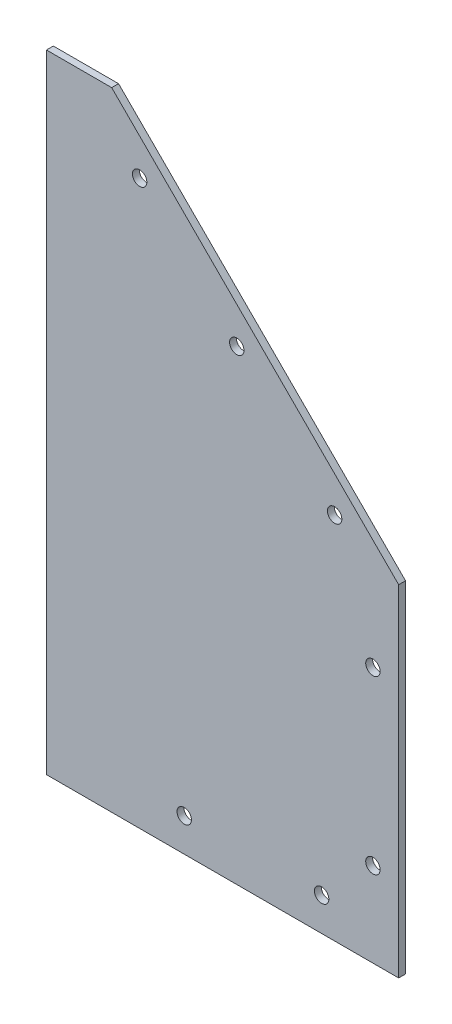
ISO-10303-21;
HEADER;
FILE_DESCRIPTION(('STEP AP214'),'2;1');
FILE_NAME('part.step','',(''),(''),'','','');
FILE_SCHEMA(('AUTOMOTIVE_DESIGN { 1 0 10303 214 1 1 1 1 }'));
ENDSEC;
DATA;
#1=APPLICATION_CONTEXT('core data for automotive mechanical design processes');
#2=APPLICATION_PROTOCOL_DEFINITION('international standard','automotive_design',2000,#1);
#3=PRODUCT_CONTEXT('',#1,'mechanical');
#4=PRODUCT('Part','Part','',(#3));
#5=PRODUCT_RELATED_PRODUCT_CATEGORY('part','',(#4));
#6=PRODUCT_DEFINITION_FORMATION('','',#4);
#7=PRODUCT_DEFINITION_CONTEXT('part definition',#1,'design');
#8=PRODUCT_DEFINITION('design','',#6,#7);
#9=PRODUCT_DEFINITION_SHAPE('','',#8);
#10=(LENGTH_UNIT() NAMED_UNIT(*) SI_UNIT(.MILLI.,.METRE.));
#11=(NAMED_UNIT(*) PLANE_ANGLE_UNIT() SI_UNIT($,.RADIAN.));
#12=(NAMED_UNIT(*) SI_UNIT($,.STERADIAN.) SOLID_ANGLE_UNIT());
#13=UNCERTAINTY_MEASURE_WITH_UNIT(LENGTH_MEASURE(1.E-05),#10,'distance_accuracy_value','');
#14=(GEOMETRIC_REPRESENTATION_CONTEXT(3) GLOBAL_UNCERTAINTY_ASSIGNED_CONTEXT((#13)) GLOBAL_UNIT_ASSIGNED_CONTEXT((#10,
#11,#12)) REPRESENTATION_CONTEXT('',''));
#15=CARTESIAN_POINT('',(0.,0.,0.));
#16=DIRECTION('',(0.,0.,1.));
#17=DIRECTION('',(1.,0.,0.));
#18=AXIS2_PLACEMENT_3D('',#15,#16,#17);
#19=CARTESIAN_POINT('',(0.,0.,2.));
#20=DIRECTION('',(0.,-1.,0.));
#21=DIRECTION('',(1.,0.,0.));
#22=AXIS2_PLACEMENT_3D('',#19,#20,#21);
#23=PLANE('',#22);
#24=DIRECTION('',(-1.,0.,0.));
#25=VECTOR('',#24,1.);
#26=CARTESIAN_POINT('',(0.,0.,0.));
#27=LINE('',#26,#25);
#28=CARTESIAN_POINT('',(83.56,0.,0.));
#29=VERTEX_POINT('',#28);
#30=CARTESIAN_POINT('',(-19.,0.,0.));
#31=VERTEX_POINT('',#30);
#32=EDGE_CURVE('E90',#29,#31,#27,.T.);
#33=ORIENTED_EDGE('',*,*,#32,.F.);
#34=DIRECTION('',(0.,0.,-1.));
#35=VECTOR('',#34,1.);
#36=CARTESIAN_POINT('',(83.56,0.,2.));
#37=LINE('',#36,#35);
#38=CARTESIAN_POINT('',(83.56,0.,2.));
#39=VERTEX_POINT('',#38);
#40=EDGE_CURVE('E11',#39,#29,#37,.T.);
#41=ORIENTED_EDGE('',*,*,#40,.F.);
#42=DIRECTION('',(-1.,0.,0.));
#43=VECTOR('',#42,1.);
#44=CARTESIAN_POINT('',(0.,0.,2.));
#45=LINE('',#44,#43);
#46=CARTESIAN_POINT('',(-19.,0.,2.));
#47=VERTEX_POINT('',#46);
#48=EDGE_CURVE('E87',#39,#47,#45,.T.);
#49=ORIENTED_EDGE('',*,*,#48,.T.);
#50=DIRECTION('',(0.,0.,1.));
#51=VECTOR('',#50,1.);
#52=CARTESIAN_POINT('',(-19.,0.,0.));
#53=LINE('',#52,#51);
#54=EDGE_CURVE('E215',#31,#47,#53,.T.);
#55=ORIENTED_EDGE('',*,*,#54,.F.);
#56=EDGE_LOOP('',(#33,#41,#49,#55));
#57=FACE_BOUND('',#56,.T.);
#58=ADVANCED_FACE('F35',(#57),#23,.T.);
#59=CARTESIAN_POINT('',(83.56,0.,2.));
#60=DIRECTION('',(1.,0.,0.));
#61=DIRECTION('',(0.,1.,0.));
#62=AXIS2_PLACEMENT_3D('',#59,#60,#61);
#63=PLANE('',#62);
#64=DIRECTION('',(0.,-1.,0.));
#65=VECTOR('',#64,1.);
#66=CARTESIAN_POINT('',(83.56,0.,0.));
#67=LINE('',#66,#65);
#68=CARTESIAN_POINT('',(83.56,99.17,0.));
#69=VERTEX_POINT('',#68);
#70=EDGE_CURVE('E123',#69,#29,#67,.T.);
#71=ORIENTED_EDGE('',*,*,#70,.F.);
#72=DIRECTION('',(0.,0.,-1.));
#73=VECTOR('',#72,1.);
#74=CARTESIAN_POINT('',(83.56,99.17,2.));
#75=LINE('',#74,#73);
#76=CARTESIAN_POINT('',(83.56,99.17,2.));
#77=VERTEX_POINT('',#76);
#78=EDGE_CURVE('E45',#77,#69,#75,.T.);
#79=ORIENTED_EDGE('',*,*,#78,.F.);
#80=DIRECTION('',(0.,-1.,0.));
#81=VECTOR('',#80,1.);
#82=CARTESIAN_POINT('',(83.56,0.,2.));
#83=LINE('',#82,#81);
#84=EDGE_CURVE('E96',#77,#39,#83,.T.);
#85=ORIENTED_EDGE('',*,*,#84,.T.);
#86=ORIENTED_EDGE('',*,*,#40,.T.);
#87=EDGE_LOOP('',(#71,#79,#85,#86));
#88=FACE_BOUND('',#87,.T.);
#89=ADVANCED_FACE('F101',(#88),#63,.T.);
#90=CARTESIAN_POINT('',(91.365,91.365,2.));
#91=DIRECTION('',(0.707106781186547,0.707106781186547,0.));
#92=DIRECTION('',(-0.707106781186548,0.707106781186548,0.));
#93=AXIS2_PLACEMENT_3D('',#90,#91,#92);
#94=PLANE('',#93);
#95=DIRECTION('',(0.707106781186548,-0.707106781186548,0.));
#96=VECTOR('',#95,1.);
#97=CARTESIAN_POINT('',(91.365,91.365,0.));
#98=LINE('',#97,#96);
#99=CARTESIAN_POINT('',(0.,182.73,0.));
#100=VERTEX_POINT('',#99);
#101=EDGE_CURVE('E125',#100,#69,#98,.T.);
#102=ORIENTED_EDGE('',*,*,#101,.F.);
#103=DIRECTION('',(0.,0.,-1.));
#104=VECTOR('',#103,1.);
#105=CARTESIAN_POINT('',(0.,182.73,2.));
#106=LINE('',#105,#104);
#107=CARTESIAN_POINT('',(0.,182.73,2.));
#108=VERTEX_POINT('',#107);
#109=EDGE_CURVE('E54',#108,#100,#106,.T.);
#110=ORIENTED_EDGE('',*,*,#109,.F.);
#111=DIRECTION('',(0.707106781186548,-0.707106781186548,0.));
#112=VECTOR('',#111,1.);
#113=CARTESIAN_POINT('',(91.365,91.365,2.));
#114=LINE('',#113,#112);
#115=EDGE_CURVE('E102',#108,#77,#114,.T.);
#116=ORIENTED_EDGE('',*,*,#115,.T.);
#117=ORIENTED_EDGE('',*,*,#78,.T.);
#118=EDGE_LOOP('',(#102,#110,#116,#117));
#119=FACE_BOUND('',#118,.T.);
#120=ADVANCED_FACE('F183',(#119),#94,.T.);
#121=CARTESIAN_POINT('',(8.13291965083095,163.990478631371,2.));
#122=DIRECTION('',(0.,0.,-1.));
#123=DIRECTION('',(-1.,0.,0.));
#124=AXIS2_PLACEMENT_3D('',#121,#122,#123);
#125=CYLINDRICAL_SURFACE('',#124,2.10000000000004);
#126=CARTESIAN_POINT('',(8.13291965083095,163.990478631371,2.));
#127=DIRECTION('',(0.,0.,1.));
#128=DIRECTION('',(1.,0.,0.));
#129=AXIS2_PLACEMENT_3D('',#126,#127,#128);
#130=CIRCLE('',#129,2.10000000000004);
#131=CARTESIAN_POINT('',(10.232919650831,163.990478631371,2.));
#132=VERTEX_POINT('',#131);
#133=EDGE_CURVE('E99',#132,#132,#130,.T.);
#134=ORIENTED_EDGE('',*,*,#133,.T.);
#135=EDGE_LOOP('',(#134));
#136=FACE_BOUND('',#135,.T.);
#137=CARTESIAN_POINT('',(8.13291965083095,163.990478631371,0.));
#138=DIRECTION('',(0.,0.,1.));
#139=DIRECTION('',(1.,0.,0.));
#140=AXIS2_PLACEMENT_3D('',#137,#138,#139);
#141=CIRCLE('',#140,2.10000000000004);
#142=CARTESIAN_POINT('',(10.232919650831,163.990478631371,0.));
#143=VERTEX_POINT('',#142);
#144=EDGE_CURVE('E119',#143,#143,#141,.T.);
#145=ORIENTED_EDGE('',*,*,#144,.F.);
#146=EDGE_LOOP('',(#145));
#147=FACE_BOUND('',#146,.T.);
#148=ADVANCED_FACE('F160',(#136,#147),#125,.F.);
#149=CARTESIAN_POINT('',(36.4171908982929,135.706207383909,2.));
#150=DIRECTION('',(0.,0.,-1.));
#151=DIRECTION('',(-1.,0.,0.));
#152=AXIS2_PLACEMENT_3D('',#149,#150,#151);
#153=CYLINDRICAL_SURFACE('',#152,2.09999999999999);
#154=CARTESIAN_POINT('',(36.4171908982929,135.706207383909,2.));
#155=DIRECTION('',(0.,0.,1.));
#156=DIRECTION('',(1.,0.,0.));
#157=AXIS2_PLACEMENT_3D('',#154,#155,#156);
#158=CIRCLE('',#157,2.09999999999999);
#159=CARTESIAN_POINT('',(38.5171908982928,135.706207383909,2.));
#160=VERTEX_POINT('',#159);
#161=EDGE_CURVE('E155',#160,#160,#158,.T.);
#162=ORIENTED_EDGE('',*,*,#161,.T.);
#163=EDGE_LOOP('',(#162));
#164=FACE_BOUND('',#163,.T.);
#165=CARTESIAN_POINT('',(36.4171908982929,135.706207383909,0.));
#166=DIRECTION('',(0.,0.,1.));
#167=DIRECTION('',(1.,0.,0.));
#168=AXIS2_PLACEMENT_3D('',#165,#166,#167);
#169=CIRCLE('',#168,2.09999999999999);
#170=CARTESIAN_POINT('',(38.5171908982928,135.706207383909,0.));
#171=VERTEX_POINT('',#170);
#172=EDGE_CURVE('E116',#171,#171,#169,.T.);
#173=ORIENTED_EDGE('',*,*,#172,.F.);
#174=EDGE_LOOP('',(#173));
#175=FACE_BOUND('',#174,.T.);
#176=ADVANCED_FACE('F189',(#164,#175),#153,.F.);
#177=CARTESIAN_POINT('',(64.9100261398927,107.42849037455,2.));
#178=DIRECTION('',(0.,0.,-1.));
#179=DIRECTION('',(-1.,0.,0.));
#180=AXIS2_PLACEMENT_3D('',#177,#178,#179);
#181=CYLINDRICAL_SURFACE('',#180,2.1);
#182=CARTESIAN_POINT('',(64.9100261398927,107.42849037455,2.));
#183=DIRECTION('',(0.,0.,1.));
#184=DIRECTION('',(1.,0.,0.));
#185=AXIS2_PLACEMENT_3D('',#182,#183,#184);
#186=CIRCLE('',#185,2.1);
#187=CARTESIAN_POINT('',(67.0100261398927,107.42849037455,2.));
#188=VERTEX_POINT('',#187);
#189=EDGE_CURVE('E152',#188,#188,#186,.T.);
#190=ORIENTED_EDGE('',*,*,#189,.T.);
#191=EDGE_LOOP('',(#190));
#192=FACE_BOUND('',#191,.T.);
#193=CARTESIAN_POINT('',(64.9100261398927,107.42849037455,0.));
#194=DIRECTION('',(0.,0.,1.));
#195=DIRECTION('',(1.,0.,0.));
#196=AXIS2_PLACEMENT_3D('',#193,#194,#195);
#197=CIRCLE('',#196,2.1);
#198=CARTESIAN_POINT('',(67.0100261398927,107.42849037455,0.));
#199=VERTEX_POINT('',#198);
#200=EDGE_CURVE('E113',#199,#199,#197,.T.);
#201=ORIENTED_EDGE('',*,*,#200,.F.);
#202=EDGE_LOOP('',(#201));
#203=FACE_BOUND('',#202,.T.);
#204=ADVANCED_FACE('F192',(#192,#203),#181,.F.);
#205=CARTESIAN_POINT('',(76.06,74.59,2.));
#206=DIRECTION('',(0.,0.,-1.));
#207=DIRECTION('',(-1.,0.,0.));
#208=AXIS2_PLACEMENT_3D('',#205,#206,#207);
#209=CYLINDRICAL_SURFACE('',#208,2.1);
#210=CARTESIAN_POINT('',(76.06,74.59,2.));
#211=DIRECTION('',(0.,0.,1.));
#212=DIRECTION('',(1.,0.,0.));
#213=AXIS2_PLACEMENT_3D('',#210,#211,#212);
#214=CIRCLE('',#213,2.1);
#215=CARTESIAN_POINT('',(78.16,74.59,2.));
#216=VERTEX_POINT('',#215);
#217=EDGE_CURVE('E149',#216,#216,#214,.T.);
#218=ORIENTED_EDGE('',*,*,#217,.T.);
#219=EDGE_LOOP('',(#218));
#220=FACE_BOUND('',#219,.T.);
#221=CARTESIAN_POINT('',(76.06,74.59,0.));
#222=DIRECTION('',(0.,0.,1.));
#223=DIRECTION('',(1.,0.,0.));
#224=AXIS2_PLACEMENT_3D('',#221,#222,#223);
#225=CIRCLE('',#224,2.1);
#226=CARTESIAN_POINT('',(78.16,74.59,0.));
#227=VERTEX_POINT('',#226);
#228=EDGE_CURVE('E110',#227,#227,#225,.T.);
#229=ORIENTED_EDGE('',*,*,#228,.F.);
#230=EDGE_LOOP('',(#229));
#231=FACE_BOUND('',#230,.T.);
#232=ADVANCED_FACE('F174',(#220,#231),#209,.F.);
#233=CARTESIAN_POINT('',(76.06,24.59,2.));
#234=DIRECTION('',(0.,0.,-1.));
#235=DIRECTION('',(-1.,0.,0.));
#236=AXIS2_PLACEMENT_3D('',#233,#234,#235);
#237=CYLINDRICAL_SURFACE('',#236,2.1);
#238=CARTESIAN_POINT('',(76.06,24.59,2.));
#239=DIRECTION('',(0.,0.,1.));
#240=DIRECTION('',(1.,0.,0.));
#241=AXIS2_PLACEMENT_3D('',#238,#239,#240);
#242=CIRCLE('',#241,2.1);
#243=CARTESIAN_POINT('',(78.16,24.59,2.));
#244=VERTEX_POINT('',#243);
#245=EDGE_CURVE('E128',#244,#244,#242,.T.);
#246=ORIENTED_EDGE('',*,*,#245,.T.);
#247=EDGE_LOOP('',(#246));
#248=FACE_BOUND('',#247,.T.);
#249=CARTESIAN_POINT('',(76.06,24.59,0.));
#250=DIRECTION('',(0.,0.,1.));
#251=DIRECTION('',(1.,0.,0.));
#252=AXIS2_PLACEMENT_3D('',#249,#250,#251);
#253=CIRCLE('',#252,2.1);
#254=CARTESIAN_POINT('',(78.16,24.59,0.));
#255=VERTEX_POINT('',#254);
#256=EDGE_CURVE('E107',#255,#255,#253,.T.);
#257=ORIENTED_EDGE('',*,*,#256,.F.);
#258=EDGE_LOOP('',(#257));
#259=FACE_BOUND('',#258,.T.);
#260=ADVANCED_FACE('F37',(#248,#259),#237,.F.);
#261=CARTESIAN_POINT('',(0.,0.,2.));
#262=DIRECTION('',(0.,0.,1.));
#263=DIRECTION('',(1.,0.,0.));
#264=AXIS2_PLACEMENT_3D('',#261,#262,#263);
#265=PLANE('',#264);
#266=CARTESIAN_POINT('',(21.12,9.69,2.));
#267=DIRECTION('',(0.,0.,1.));
#268=DIRECTION('',(1.,0.,0.));
#269=AXIS2_PLACEMENT_3D('',#266,#267,#268);
#270=CIRCLE('',#269,2.1);
#271=CARTESIAN_POINT('',(23.22,9.69,2.));
#272=VERTEX_POINT('',#271);
#273=EDGE_CURVE('E132',#272,#272,#270,.T.);
#274=ORIENTED_EDGE('',*,*,#273,.F.);
#275=EDGE_LOOP('',(#274));
#276=FACE_BOUND('',#275,.T.);
#277=CARTESIAN_POINT('',(61.12,9.69,2.));
#278=DIRECTION('',(0.,0.,1.));
#279=DIRECTION('',(1.,0.,0.));
#280=AXIS2_PLACEMENT_3D('',#277,#278,#279);
#281=CIRCLE('',#280,2.1);
#282=CARTESIAN_POINT('',(63.22,9.69,2.));
#283=VERTEX_POINT('',#282);
#284=EDGE_CURVE('E137',#283,#283,#281,.T.);
#285=ORIENTED_EDGE('',*,*,#284,.F.);
#286=EDGE_LOOP('',(#285));
#287=FACE_BOUND('',#286,.T.);
#288=ORIENTED_EDGE('',*,*,#245,.F.);
#289=EDGE_LOOP('',(#288));
#290=FACE_BOUND('',#289,.T.);
#291=ORIENTED_EDGE('',*,*,#217,.F.);
#292=EDGE_LOOP('',(#291));
#293=FACE_BOUND('',#292,.T.);
#294=ORIENTED_EDGE('',*,*,#189,.F.);
#295=EDGE_LOOP('',(#294));
#296=FACE_BOUND('',#295,.T.);
#297=ORIENTED_EDGE('',*,*,#161,.F.);
#298=EDGE_LOOP('',(#297));
#299=FACE_BOUND('',#298,.T.);
#300=ORIENTED_EDGE('',*,*,#133,.F.);
#301=EDGE_LOOP('',(#300));
#302=FACE_BOUND('',#301,.T.);
#303=ORIENTED_EDGE('',*,*,#48,.F.);
#304=ORIENTED_EDGE('',*,*,#84,.F.);
#305=ORIENTED_EDGE('',*,*,#115,.F.);
#306=DIRECTION('',(1.,0.,0.));
#307=VECTOR('',#306,1.);
#308=CARTESIAN_POINT('',(-19.,182.73,1.99999999999998));
#309=LINE('',#308,#307);
#310=CARTESIAN_POINT('',(-19.,182.73,1.99999999999998));
#311=VERTEX_POINT('',#310);
#312=EDGE_CURVE('E142',#311,#108,#309,.T.);
#313=ORIENTED_EDGE('',*,*,#312,.F.);
#314=DIRECTION('',(0.,1.,0.));
#315=VECTOR('',#314,1.);
#316=CARTESIAN_POINT('',(-19.,182.73,1.99999999999998));
#317=LINE('',#316,#315);
#318=EDGE_CURVE('E98',#47,#311,#317,.T.);
#319=ORIENTED_EDGE('',*,*,#318,.F.);
#320=EDGE_LOOP('',(#303,#304,#305,#313,#319));
#321=FACE_BOUND('',#320,.T.);
#322=ADVANCED_FACE('F95',(#276,#287,#290,#293,#296,#299,#302,#321),#265,.T.);
#323=CARTESIAN_POINT('',(0.,0.,0.));
#324=DIRECTION('',(0.,0.,1.));
#325=DIRECTION('',(1.,0.,0.));
#326=AXIS2_PLACEMENT_3D('',#323,#324,#325);
#327=PLANE('',#326);
#328=CARTESIAN_POINT('',(21.12,9.69,0.));
#329=DIRECTION('',(0.,0.,1.));
#330=DIRECTION('',(1.,0.,0.));
#331=AXIS2_PLACEMENT_3D('',#328,#329,#330);
#332=CIRCLE('',#331,2.1);
#333=CARTESIAN_POINT('',(23.22,9.69,0.));
#334=VERTEX_POINT('',#333);
#335=EDGE_CURVE('E39',#334,#334,#332,.T.);
#336=ORIENTED_EDGE('',*,*,#335,.T.);
#337=EDGE_LOOP('',(#336));
#338=FACE_BOUND('',#337,.T.);
#339=CARTESIAN_POINT('',(61.12,9.69,0.));
#340=DIRECTION('',(0.,0.,1.));
#341=DIRECTION('',(1.,0.,0.));
#342=AXIS2_PLACEMENT_3D('',#339,#340,#341);
#343=CIRCLE('',#342,2.1);
#344=CARTESIAN_POINT('',(63.22,9.69,0.));
#345=VERTEX_POINT('',#344);
#346=EDGE_CURVE('E130',#345,#345,#343,.T.);
#347=ORIENTED_EDGE('',*,*,#346,.T.);
#348=EDGE_LOOP('',(#347));
#349=FACE_BOUND('',#348,.T.);
#350=ORIENTED_EDGE('',*,*,#256,.T.);
#351=EDGE_LOOP('',(#350));
#352=FACE_BOUND('',#351,.T.);
#353=ORIENTED_EDGE('',*,*,#228,.T.);
#354=EDGE_LOOP('',(#353));
#355=FACE_BOUND('',#354,.T.);
#356=ORIENTED_EDGE('',*,*,#200,.T.);
#357=EDGE_LOOP('',(#356));
#358=FACE_BOUND('',#357,.T.);
#359=ORIENTED_EDGE('',*,*,#172,.T.);
#360=EDGE_LOOP('',(#359));
#361=FACE_BOUND('',#360,.T.);
#362=ORIENTED_EDGE('',*,*,#144,.T.);
#363=EDGE_LOOP('',(#362));
#364=FACE_BOUND('',#363,.T.);
#365=ORIENTED_EDGE('',*,*,#32,.T.);
#366=DIRECTION('',(0.,-1.,0.));
#367=VECTOR('',#366,1.);
#368=CARTESIAN_POINT('',(-19.,182.73,0.));
#369=LINE('',#368,#367);
#370=CARTESIAN_POINT('',(-19.,182.73,0.));
#371=VERTEX_POINT('',#370);
#372=EDGE_CURVE('E213',#371,#31,#369,.T.);
#373=ORIENTED_EDGE('',*,*,#372,.F.);
#374=DIRECTION('',(1.,0.,0.));
#375=VECTOR('',#374,1.);
#376=CARTESIAN_POINT('',(-19.,182.73,0.));
#377=LINE('',#376,#375);
#378=EDGE_CURVE('E221',#371,#100,#377,.T.);
#379=ORIENTED_EDGE('',*,*,#378,.T.);
#380=ORIENTED_EDGE('',*,*,#101,.T.);
#381=ORIENTED_EDGE('',*,*,#70,.T.);
#382=EDGE_LOOP('',(#365,#373,#379,#380,#381));
#383=FACE_BOUND('',#382,.T.);
#384=ADVANCED_FACE('F164',(#338,#349,#352,#355,#358,#361,#364,#383),#327,.F.);
#385=CARTESIAN_POINT('',(61.12,9.69,-8.));
#386=DIRECTION('',(0.,0.,1.));
#387=DIRECTION('',(1.,0.,0.));
#388=AXIS2_PLACEMENT_3D('',#385,#386,#387);
#389=CYLINDRICAL_SURFACE('',#388,2.1);
#390=ORIENTED_EDGE('',*,*,#284,.T.);
#391=EDGE_LOOP('',(#390));
#392=FACE_BOUND('',#391,.T.);
#393=ORIENTED_EDGE('',*,*,#346,.F.);
#394=EDGE_LOOP('',(#393));
#395=FACE_BOUND('',#394,.T.);
#396=ADVANCED_FACE('F171',(#392,#395),#389,.F.);
#397=CARTESIAN_POINT('',(21.12,9.69,-8.));
#398=DIRECTION('',(0.,0.,1.));
#399=DIRECTION('',(1.,0.,0.));
#400=AXIS2_PLACEMENT_3D('',#397,#398,#399);
#401=CYLINDRICAL_SURFACE('',#400,2.1);
#402=ORIENTED_EDGE('',*,*,#273,.T.);
#403=EDGE_LOOP('',(#402));
#404=FACE_BOUND('',#403,.T.);
#405=ORIENTED_EDGE('',*,*,#335,.F.);
#406=EDGE_LOOP('',(#405));
#407=FACE_BOUND('',#406,.T.);
#408=ADVANCED_FACE('F262',(#404,#407),#401,.F.);
#409=CARTESIAN_POINT('',(-19.,182.73,0.));
#410=DIRECTION('',(0.,-1.,0.));
#411=DIRECTION('',(0.,0.,-1.));
#412=AXIS2_PLACEMENT_3D('',#409,#410,#411);
#413=PLANE('',#412);
#414=ORIENTED_EDGE('',*,*,#109,.T.);
#415=ORIENTED_EDGE('',*,*,#378,.F.);
#416=DIRECTION('',(0.,0.,-1.));
#417=VECTOR('',#416,1.);
#418=CARTESIAN_POINT('',(-19.,182.73,0.));
#419=LINE('',#418,#417);
#420=EDGE_CURVE('E75',#311,#371,#419,.T.);
#421=ORIENTED_EDGE('',*,*,#420,.F.);
#422=ORIENTED_EDGE('',*,*,#312,.T.);
#423=EDGE_LOOP('',(#414,#415,#421,#422));
#424=FACE_BOUND('',#423,.T.);
#425=ADVANCED_FACE('F224',(#424),#413,.F.);
#426=CARTESIAN_POINT('',(-19.,0.,0.));
#427=DIRECTION('',(-1.,0.,0.));
#428=DIRECTION('',(0.,0.,1.));
#429=AXIS2_PLACEMENT_3D('',#426,#427,#428);
#430=PLANE('',#429);
#431=ORIENTED_EDGE('',*,*,#372,.T.);
#432=ORIENTED_EDGE('',*,*,#54,.T.);
#433=ORIENTED_EDGE('',*,*,#318,.T.);
#434=ORIENTED_EDGE('',*,*,#420,.T.);
#435=EDGE_LOOP('',(#431,#432,#433,#434));
#436=FACE_BOUND('',#435,.T.);
#437=ADVANCED_FACE('F217',(#436),#430,.T.);
#438=CLOSED_SHELL('',(#58,#89,#120,#148,#176,#204,#232,#260,#322,#384,#396,#408,#425,#437));
#439=MANIFOLD_SOLID_BREP('B2',#438);
#440=ADVANCED_BREP_SHAPE_REPRESENTATION('',(#18,#439),#14);
#441=SHAPE_DEFINITION_REPRESENTATION(#9,#440);
ENDSEC;
END-ISO-10303-21;
